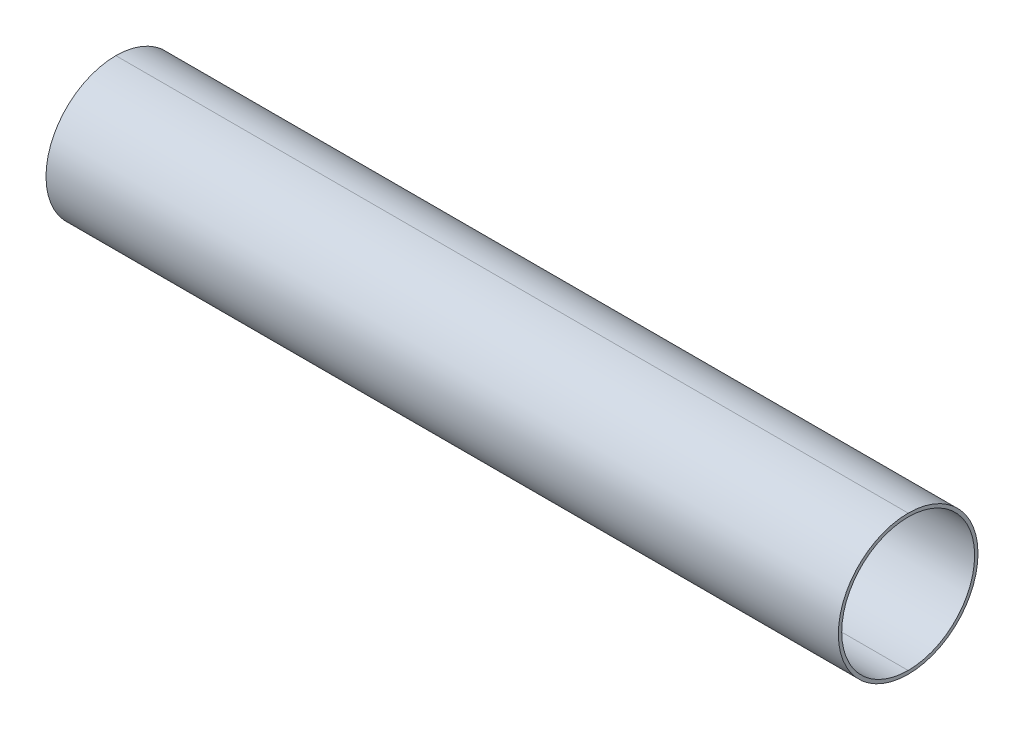
ISO-10303-21;
HEADER;
FILE_DESCRIPTION(('STEP AP214'),'2;1');
FILE_NAME('part.step','',(''),(''),'','','');
FILE_SCHEMA(('AUTOMOTIVE_DESIGN { 1 0 10303 214 1 1 1 1 }'));
ENDSEC;
DATA;
#1=APPLICATION_CONTEXT('core data for automotive mechanical design processes');
#2=APPLICATION_PROTOCOL_DEFINITION('international standard','automotive_design',2000,#1);
#3=PRODUCT_CONTEXT('',#1,'mechanical');
#4=PRODUCT('Part','Part','',(#3));
#5=PRODUCT_RELATED_PRODUCT_CATEGORY('part','',(#4));
#6=PRODUCT_DEFINITION_FORMATION('','',#4);
#7=PRODUCT_DEFINITION_CONTEXT('part definition',#1,'design');
#8=PRODUCT_DEFINITION('design','',#6,#7);
#9=PRODUCT_DEFINITION_SHAPE('','',#8);
#10=(LENGTH_UNIT() NAMED_UNIT(*) SI_UNIT(.MILLI.,.METRE.));
#11=(NAMED_UNIT(*) PLANE_ANGLE_UNIT() SI_UNIT($,.RADIAN.));
#12=(NAMED_UNIT(*) SI_UNIT($,.STERADIAN.) SOLID_ANGLE_UNIT());
#13=UNCERTAINTY_MEASURE_WITH_UNIT(LENGTH_MEASURE(1.E-05),#10,'distance_accuracy_value','');
#14=(GEOMETRIC_REPRESENTATION_CONTEXT(3) GLOBAL_UNCERTAINTY_ASSIGNED_CONTEXT((#13)) GLOBAL_UNIT_ASSIGNED_CONTEXT((#10,
#11,#12)) REPRESENTATION_CONTEXT('',''));
#15=CARTESIAN_POINT('',(0.,0.,0.));
#16=DIRECTION('',(0.,0.,1.));
#17=DIRECTION('',(1.,0.,0.));
#18=AXIS2_PLACEMENT_3D('',#15,#16,#17);
#19=CARTESIAN_POINT('',(0.,0.,0.));
#20=DIRECTION('',(1.,0.,0.));
#21=DIRECTION('',(0.,-1.,0.));
#22=AXIS2_PLACEMENT_3D('',#19,#20,#21);
#23=PLANE('',#22);
#24=CARTESIAN_POINT('',(0.,0.,0.));
#25=DIRECTION('',(-1.,0.,0.));
#26=DIRECTION('',(0.,1.,0.));
#27=AXIS2_PLACEMENT_3D('',#24,#25,#26);
#28=CIRCLE('',#27,462.28);
#29=CARTESIAN_POINT('',(0.,462.28,0.));
#30=VERTEX_POINT('',#29);
#31=CARTESIAN_POINT('',(0.,-462.28,0.));
#32=VERTEX_POINT('',#31);
#33=EDGE_CURVE('E25',#30,#32,#28,.T.);
#34=ORIENTED_EDGE('',*,*,#33,.F.);
#35=CARTESIAN_POINT('',(0.,0.,0.));
#36=DIRECTION('',(-1.,0.,0.));
#37=DIRECTION('',(0.,-1.,0.));
#38=AXIS2_PLACEMENT_3D('',#35,#36,#37);
#39=CIRCLE('',#38,462.28);
#40=EDGE_CURVE('E33',#32,#30,#39,.T.);
#41=ORIENTED_EDGE('',*,*,#40,.F.);
#42=EDGE_LOOP('',(#34,#41));
#43=FACE_BOUND('',#42,.T.);
#44=CARTESIAN_POINT('',(0.,0.,0.));
#45=DIRECTION('',(1.,0.,0.));
#46=DIRECTION('',(0.,1.,0.));
#47=AXIS2_PLACEMENT_3D('',#44,#45,#46);
#48=CIRCLE('',#47,485.775);
#49=CARTESIAN_POINT('',(0.,485.775,0.));
#50=VERTEX_POINT('',#49);
#51=CARTESIAN_POINT('',(0.,-485.775,0.));
#52=VERTEX_POINT('',#51);
#53=EDGE_CURVE('E69',#50,#52,#48,.T.);
#54=ORIENTED_EDGE('',*,*,#53,.F.);
#55=CARTESIAN_POINT('',(0.,0.,0.));
#56=DIRECTION('',(1.,0.,0.));
#57=DIRECTION('',(0.,-1.,0.));
#58=AXIS2_PLACEMENT_3D('',#55,#56,#57);
#59=CIRCLE('',#58,485.775);
#60=EDGE_CURVE('E67',#52,#50,#59,.T.);
#61=ORIENTED_EDGE('',*,*,#60,.F.);
#62=EDGE_LOOP('',(#54,#61));
#63=FACE_BOUND('',#62,.T.);
#64=ADVANCED_FACE('F15',(#43,#63),#23,.F.);
#65=CARTESIAN_POINT('',(0.,0.,0.));
#66=DIRECTION('',(-1.,0.,0.));
#67=DIRECTION('',(0.,-1.,0.));
#68=AXIS2_PLACEMENT_3D('',#65,#66,#67);
#69=CYLINDRICAL_SURFACE('',#68,462.28);
#70=DIRECTION('',(1.,0.,0.));
#71=VECTOR('',#70,1.);
#72=CARTESIAN_POINT('',(0.,-462.28,1.13225944461968E-13));
#73=LINE('',#72,#71);
#74=CARTESIAN_POINT('',(5511.8,-462.28,0.));
#75=VERTEX_POINT('',#74);
#76=EDGE_CURVE('E9',#32,#75,#73,.T.);
#77=ORIENTED_EDGE('',*,*,#76,.T.);
#78=CARTESIAN_POINT('',(5511.8,0.,0.));
#79=DIRECTION('',(-1.,0.,0.));
#80=DIRECTION('',(0.,1.,0.));
#81=AXIS2_PLACEMENT_3D('',#78,#79,#80);
#82=CIRCLE('',#81,462.28);
#83=CARTESIAN_POINT('',(5511.8,462.28,0.));
#84=VERTEX_POINT('',#83);
#85=EDGE_CURVE('E63',#84,#75,#82,.T.);
#86=ORIENTED_EDGE('',*,*,#85,.F.);
#87=DIRECTION('',(1.,0.,0.));
#88=VECTOR('',#87,1.);
#89=CARTESIAN_POINT('',(0.,462.28,0.));
#90=LINE('',#89,#88);
#91=EDGE_CURVE('E87',#30,#84,#90,.T.);
#92=ORIENTED_EDGE('',*,*,#91,.F.);
#93=ORIENTED_EDGE('',*,*,#33,.T.);
#94=EDGE_LOOP('',(#77,#86,#92,#93));
#95=FACE_BOUND('',#94,.T.);
#96=ADVANCED_FACE('F118',(#95),#69,.F.);
#97=CARTESIAN_POINT('',(0.,0.,0.));
#98=DIRECTION('',(-1.,0.,0.));
#99=DIRECTION('',(0.,-1.,0.));
#100=AXIS2_PLACEMENT_3D('',#97,#98,#99);
#101=CYLINDRICAL_SURFACE('',#100,462.28);
#102=ORIENTED_EDGE('',*,*,#91,.T.);
#103=CARTESIAN_POINT('',(5511.8,0.,0.));
#104=DIRECTION('',(-1.,0.,0.));
#105=DIRECTION('',(0.,-1.,0.));
#106=AXIS2_PLACEMENT_3D('',#103,#104,#105);
#107=CIRCLE('',#106,462.28);
#108=EDGE_CURVE('E92',#75,#84,#107,.T.);
#109=ORIENTED_EDGE('',*,*,#108,.F.);
#110=ORIENTED_EDGE('',*,*,#76,.F.);
#111=ORIENTED_EDGE('',*,*,#40,.T.);
#112=EDGE_LOOP('',(#102,#109,#110,#111));
#113=FACE_BOUND('',#112,.T.);
#114=ADVANCED_FACE('F108',(#113),#101,.F.);
#115=CARTESIAN_POINT('',(0.,0.,0.));
#116=DIRECTION('',(-1.,0.,0.));
#117=DIRECTION('',(0.,-1.,0.));
#118=AXIS2_PLACEMENT_3D('',#115,#116,#117);
#119=CYLINDRICAL_SURFACE('',#118,485.775);
#120=DIRECTION('',(1.,0.,0.));
#121=VECTOR('',#120,1.);
#122=CARTESIAN_POINT('',(0.,-485.775,0.));
#123=LINE('',#122,#121);
#124=CARTESIAN_POINT('',(5511.8,-485.775,0.));
#125=VERTEX_POINT('',#124);
#126=EDGE_CURVE('E76',#52,#125,#123,.T.);
#127=ORIENTED_EDGE('',*,*,#126,.T.);
#128=CARTESIAN_POINT('',(5511.8,0.,0.));
#129=DIRECTION('',(1.,0.,0.));
#130=DIRECTION('',(0.,1.,0.));
#131=AXIS2_PLACEMENT_3D('',#128,#129,#130);
#132=CIRCLE('',#131,485.775);
#133=CARTESIAN_POINT('',(5511.8,485.775,0.));
#134=VERTEX_POINT('',#133);
#135=EDGE_CURVE('E51',#134,#125,#132,.T.);
#136=ORIENTED_EDGE('',*,*,#135,.F.);
#137=DIRECTION('',(1.,0.,0.));
#138=VECTOR('',#137,1.);
#139=CARTESIAN_POINT('',(0.,485.775,0.));
#140=LINE('',#139,#138);
#141=EDGE_CURVE('E73',#50,#134,#140,.T.);
#142=ORIENTED_EDGE('',*,*,#141,.F.);
#143=ORIENTED_EDGE('',*,*,#53,.T.);
#144=EDGE_LOOP('',(#127,#136,#142,#143));
#145=FACE_BOUND('',#144,.T.);
#146=ADVANCED_FACE('F75',(#145),#119,.T.);
#147=CARTESIAN_POINT('',(0.,0.,0.));
#148=DIRECTION('',(-1.,0.,0.));
#149=DIRECTION('',(0.,-1.,0.));
#150=AXIS2_PLACEMENT_3D('',#147,#148,#149);
#151=CYLINDRICAL_SURFACE('',#150,485.775);
#152=ORIENTED_EDGE('',*,*,#141,.T.);
#153=CARTESIAN_POINT('',(5511.8,0.,0.));
#154=DIRECTION('',(1.,0.,0.));
#155=DIRECTION('',(0.,-1.,0.));
#156=AXIS2_PLACEMENT_3D('',#153,#154,#155);
#157=CIRCLE('',#156,485.775);
#158=EDGE_CURVE('E19',#125,#134,#157,.T.);
#159=ORIENTED_EDGE('',*,*,#158,.F.);
#160=ORIENTED_EDGE('',*,*,#126,.F.);
#161=ORIENTED_EDGE('',*,*,#60,.T.);
#162=EDGE_LOOP('',(#152,#159,#160,#161));
#163=FACE_BOUND('',#162,.T.);
#164=ADVANCED_FACE('F80',(#163),#151,.T.);
#165=CARTESIAN_POINT('',(5511.8,0.,0.));
#166=DIRECTION('',(1.,0.,0.));
#167=DIRECTION('',(0.,-1.,0.));
#168=AXIS2_PLACEMENT_3D('',#165,#166,#167);
#169=PLANE('',#168);
#170=ORIENTED_EDGE('',*,*,#85,.T.);
#171=ORIENTED_EDGE('',*,*,#108,.T.);
#172=EDGE_LOOP('',(#170,#171));
#173=FACE_BOUND('',#172,.T.);
#174=ORIENTED_EDGE('',*,*,#135,.T.);
#175=ORIENTED_EDGE('',*,*,#158,.T.);
#176=EDGE_LOOP('',(#174,#175));
#177=FACE_BOUND('',#176,.T.);
#178=ADVANCED_FACE('F17',(#173,#177),#169,.T.);
#179=CLOSED_SHELL('',(#64,#96,#114,#146,#164,#178));
#180=MANIFOLD_SOLID_BREP('B1',#179);
#181=ADVANCED_BREP_SHAPE_REPRESENTATION('',(#18,#180),#14);
#182=SHAPE_DEFINITION_REPRESENTATION(#9,#181);
ENDSEC;
END-ISO-10303-21;
